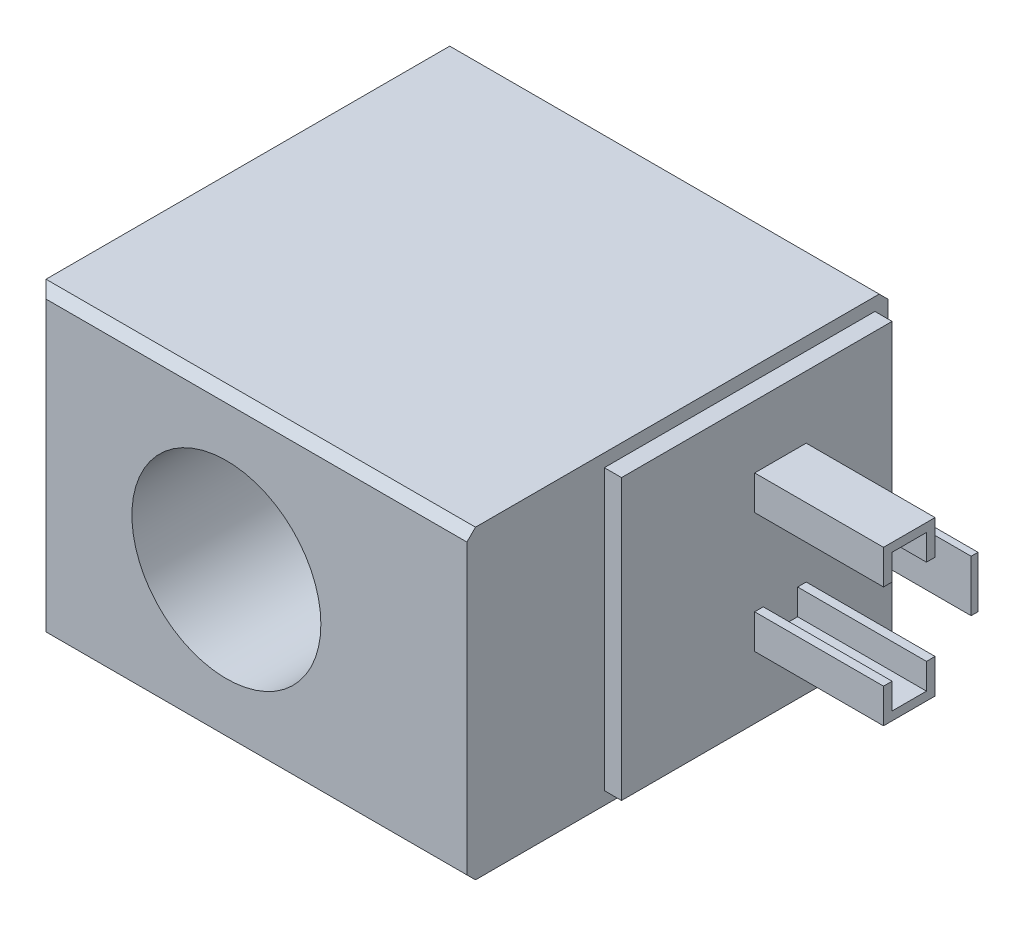
ISO-10303-21;
HEADER;
FILE_DESCRIPTION(('STEP AP214'),'2;1');
FILE_NAME('part.step','',(''),(''),'','','');
FILE_SCHEMA(('AUTOMOTIVE_DESIGN { 1 0 10303 214 1 1 1 1 }'));
ENDSEC;
DATA;
#1=APPLICATION_CONTEXT('core data for automotive mechanical design processes');
#2=APPLICATION_PROTOCOL_DEFINITION('international standard','automotive_design',2000,#1);
#3=PRODUCT_CONTEXT('',#1,'mechanical');
#4=PRODUCT('Part','Part','',(#3));
#5=PRODUCT_RELATED_PRODUCT_CATEGORY('part','',(#4));
#6=PRODUCT_DEFINITION_FORMATION('','',#4);
#7=PRODUCT_DEFINITION_CONTEXT('part definition',#1,'design');
#8=PRODUCT_DEFINITION('design','',#6,#7);
#9=PRODUCT_DEFINITION_SHAPE('','',#8);
#10=(LENGTH_UNIT() NAMED_UNIT(*) SI_UNIT(.MILLI.,.METRE.));
#11=(NAMED_UNIT(*) PLANE_ANGLE_UNIT() SI_UNIT($,.RADIAN.));
#12=(NAMED_UNIT(*) SI_UNIT($,.STERADIAN.) SOLID_ANGLE_UNIT());
#13=UNCERTAINTY_MEASURE_WITH_UNIT(LENGTH_MEASURE(1.E-05),#10,'distance_accuracy_value','');
#14=(GEOMETRIC_REPRESENTATION_CONTEXT(3) GLOBAL_UNCERTAINTY_ASSIGNED_CONTEXT((#13)) GLOBAL_UNIT_ASSIGNED_CONTEXT((#10,
#11,#12)) REPRESENTATION_CONTEXT('',''));
#15=CARTESIAN_POINT('',(0.,0.,0.));
#16=DIRECTION('',(0.,0.,1.));
#17=DIRECTION('',(1.,0.,0.));
#18=AXIS2_PLACEMENT_3D('',#15,#16,#17);
#19=CARTESIAN_POINT('',(27.,0.,0.));
#20=DIRECTION('',(-1.,0.,0.));
#21=DIRECTION('',(0.,0.,1.));
#22=AXIS2_PLACEMENT_3D('',#19,#20,#21);
#23=PLANE('',#22);
#24=DIRECTION('',(0.,-1.,0.));
#25=VECTOR('',#24,1.);
#26=CARTESIAN_POINT('',(27.,3.,7.3));
#27=LINE('',#26,#25);
#28=CARTESIAN_POINT('',(27.,3.,7.3));
#29=VERTEX_POINT('',#28);
#30=CARTESIAN_POINT('',(27.,-3.,7.3));
#31=VERTEX_POINT('',#30);
#32=EDGE_CURVE('E278',#29,#31,#27,.T.);
#33=ORIENTED_EDGE('',*,*,#32,.F.);
#34=DIRECTION('',(0.,0.,1.));
#35=VECTOR('',#34,1.);
#36=CARTESIAN_POINT('',(27.,3.,7.3));
#37=LINE('',#36,#35);
#38=CARTESIAN_POINT('',(27.,3.,6.5));
#39=VERTEX_POINT('',#38);
#40=EDGE_CURVE('E294',#39,#29,#37,.T.);
#41=ORIENTED_EDGE('',*,*,#40,.F.);
#42=DIRECTION('',(0.,1.,0.));
#43=VECTOR('',#42,1.);
#44=CARTESIAN_POINT('',(27.,3.,6.5));
#45=LINE('',#44,#43);
#46=CARTESIAN_POINT('',(27.,-3.,6.5));
#47=VERTEX_POINT('',#46);
#48=EDGE_CURVE('E307',#47,#39,#45,.T.);
#49=ORIENTED_EDGE('',*,*,#48,.F.);
#50=DIRECTION('',(0.,0.,-1.));
#51=VECTOR('',#50,1.);
#52=CARTESIAN_POINT('',(27.,-3.,7.3));
#53=LINE('',#52,#51);
#54=EDGE_CURVE('E283',#31,#47,#53,.T.);
#55=ORIENTED_EDGE('',*,*,#54,.F.);
#56=EDGE_LOOP('',(#33,#41,#49,#55));
#57=FACE_BOUND('',#56,.T.);
#58=DIRECTION('',(0.,0.,1.));
#59=VECTOR('',#58,1.);
#60=CARTESIAN_POINT('',(27.,16.28,33.));
#61=LINE('',#60,#59);
#62=CARTESIAN_POINT('',(27.,16.28,1.5));
#63=VERTEX_POINT('',#62);
#64=CARTESIAN_POINT('',(27.,16.28,33.));
#65=VERTEX_POINT('',#64);
#66=EDGE_CURVE('E419',#63,#65,#61,.T.);
#67=ORIENTED_EDGE('',*,*,#66,.T.);
#68=DIRECTION('',(0.,-1.,0.));
#69=VECTOR('',#68,1.);
#70=CARTESIAN_POINT('',(27.,16.28,33.));
#71=LINE('',#70,#69);
#72=CARTESIAN_POINT('',(27.,-16.28,33.));
#73=VERTEX_POINT('',#72);
#74=EDGE_CURVE('E423',#65,#73,#71,.T.);
#75=ORIENTED_EDGE('',*,*,#74,.T.);
#76=DIRECTION('',(0.,0.,-1.));
#77=VECTOR('',#76,1.);
#78=CARTESIAN_POINT('',(27.,-16.28,1.5));
#79=LINE('',#78,#77);
#80=CARTESIAN_POINT('',(27.,-16.28,1.5));
#81=VERTEX_POINT('',#80);
#82=EDGE_CURVE('E427',#73,#81,#79,.T.);
#83=ORIENTED_EDGE('',*,*,#82,.T.);
#84=DIRECTION('',(0.,1.,0.));
#85=VECTOR('',#84,1.);
#86=CARTESIAN_POINT('',(27.,16.28,1.5));
#87=LINE('',#86,#85);
#88=EDGE_CURVE('E430',#81,#63,#87,.T.);
#89=ORIENTED_EDGE('',*,*,#88,.T.);
#90=EDGE_LOOP('',(#67,#75,#83,#89));
#91=FACE_BOUND('',#90,.T.);
#92=DIRECTION('',(0.,-1.,0.));
#93=VECTOR('',#92,1.);
#94=CARTESIAN_POINT('',(27.,5.,17.5));
#95=LINE('',#94,#93);
#96=CARTESIAN_POINT('',(27.,9.,17.5));
#97=VERTEX_POINT('',#96);
#98=CARTESIAN_POINT('',(27.,5.,17.5));
#99=VERTEX_POINT('',#98);
#100=EDGE_CURVE('E329',#97,#99,#95,.T.);
#101=ORIENTED_EDGE('',*,*,#100,.F.);
#102=DIRECTION('',(0.,0.,1.));
#103=VECTOR('',#102,1.);
#104=CARTESIAN_POINT('',(27.,9.,17.5));
#105=LINE('',#104,#103);
#106=CARTESIAN_POINT('',(27.,9.,11.5));
#107=VERTEX_POINT('',#106);
#108=EDGE_CURVE('E335',#107,#97,#105,.T.);
#109=ORIENTED_EDGE('',*,*,#108,.F.);
#110=DIRECTION('',(0.,1.,0.));
#111=VECTOR('',#110,1.);
#112=CARTESIAN_POINT('',(27.,5.,11.5));
#113=LINE('',#112,#111);
#114=CARTESIAN_POINT('',(27.,5.,11.5));
#115=VERTEX_POINT('',#114);
#116=EDGE_CURVE('E380',#115,#107,#113,.T.);
#117=ORIENTED_EDGE('',*,*,#116,.F.);
#118=DIRECTION('',(0.,0.,-1.));
#119=VECTOR('',#118,1.);
#120=CARTESIAN_POINT('',(27.,5.,12.5));
#121=LINE('',#120,#119);
#122=CARTESIAN_POINT('',(27.,5.,12.5));
#123=VERTEX_POINT('',#122);
#124=EDGE_CURVE('E376',#123,#115,#121,.T.);
#125=ORIENTED_EDGE('',*,*,#124,.F.);
#126=DIRECTION('',(0.,-1.,0.));
#127=VECTOR('',#126,1.);
#128=CARTESIAN_POINT('',(27.,5.,12.5));
#129=LINE('',#128,#127);
#130=CARTESIAN_POINT('',(27.,8.,12.5));
#131=VERTEX_POINT('',#130);
#132=EDGE_CURVE('E372',#131,#123,#129,.T.);
#133=ORIENTED_EDGE('',*,*,#132,.F.);
#134=DIRECTION('',(0.,0.,-1.));
#135=VECTOR('',#134,1.);
#136=CARTESIAN_POINT('',(27.,8.,16.5));
#137=LINE('',#136,#135);
#138=CARTESIAN_POINT('',(27.,8.,16.5));
#139=VERTEX_POINT('',#138);
#140=EDGE_CURVE('E368',#139,#131,#137,.T.);
#141=ORIENTED_EDGE('',*,*,#140,.F.);
#142=DIRECTION('',(0.,1.,0.));
#143=VECTOR('',#142,1.);
#144=CARTESIAN_POINT('',(27.,5.,16.5));
#145=LINE('',#144,#143);
#146=CARTESIAN_POINT('',(27.,5.,16.5));
#147=VERTEX_POINT('',#146);
#148=EDGE_CURVE('E364',#147,#139,#145,.T.);
#149=ORIENTED_EDGE('',*,*,#148,.F.);
#150=DIRECTION('',(0.,0.,-1.));
#151=VECTOR('',#150,1.);
#152=CARTESIAN_POINT('',(27.,5.,17.5));
#153=LINE('',#152,#151);
#154=EDGE_CURVE('E360',#99,#147,#153,.T.);
#155=ORIENTED_EDGE('',*,*,#154,.F.);
#156=EDGE_LOOP('',(#101,#109,#117,#125,#133,#141,#149,#155));
#157=FACE_BOUND('',#156,.T.);
#158=DIRECTION('',(0.,-1.,0.));
#159=VECTOR('',#158,1.);
#160=CARTESIAN_POINT('',(27.,-5.,12.5));
#161=LINE('',#160,#159);
#162=CARTESIAN_POINT('',(27.,-5.,12.5));
#163=VERTEX_POINT('',#162);
#164=CARTESIAN_POINT('',(27.,-8.,12.5));
#165=VERTEX_POINT('',#164);
#166=EDGE_CURVE('E276',#163,#165,#161,.T.);
#167=ORIENTED_EDGE('',*,*,#166,.F.);
#168=DIRECTION('',(0.,0.,1.));
#169=VECTOR('',#168,1.);
#170=CARTESIAN_POINT('',(27.,-5.,12.5));
#171=LINE('',#170,#169);
#172=CARTESIAN_POINT('',(27.,-5.,11.5));
#173=VERTEX_POINT('',#172);
#174=EDGE_CURVE('E273',#173,#163,#171,.T.);
#175=ORIENTED_EDGE('',*,*,#174,.F.);
#176=DIRECTION('',(0.,1.,0.));
#177=VECTOR('',#176,1.);
#178=CARTESIAN_POINT('',(27.,-5.,11.5));
#179=LINE('',#178,#177);
#180=CARTESIAN_POINT('',(27.,-9.,11.5));
#181=VERTEX_POINT('',#180);
#182=EDGE_CURVE('E664',#181,#173,#179,.T.);
#183=ORIENTED_EDGE('',*,*,#182,.F.);
#184=DIRECTION('',(0.,0.,-1.));
#185=VECTOR('',#184,1.);
#186=CARTESIAN_POINT('',(27.,-9.,17.5));
#187=LINE('',#186,#185);
#188=CARTESIAN_POINT('',(27.,-9.,17.5));
#189=VERTEX_POINT('',#188);
#190=EDGE_CURVE('E711',#189,#181,#187,.T.);
#191=ORIENTED_EDGE('',*,*,#190,.F.);
#192=DIRECTION('',(0.,-1.,0.));
#193=VECTOR('',#192,1.);
#194=CARTESIAN_POINT('',(27.,-5.,17.5));
#195=LINE('',#194,#193);
#196=CARTESIAN_POINT('',(27.,-5.,17.5));
#197=VERTEX_POINT('',#196);
#198=EDGE_CURVE('E704',#197,#189,#195,.T.);
#199=ORIENTED_EDGE('',*,*,#198,.F.);
#200=DIRECTION('',(0.,0.,1.));
#201=VECTOR('',#200,1.);
#202=CARTESIAN_POINT('',(27.,-5.,17.5));
#203=LINE('',#202,#201);
#204=CARTESIAN_POINT('',(27.,-5.,16.5));
#205=VERTEX_POINT('',#204);
#206=EDGE_CURVE('E694',#205,#197,#203,.T.);
#207=ORIENTED_EDGE('',*,*,#206,.F.);
#208=DIRECTION('',(0.,1.,0.));
#209=VECTOR('',#208,1.);
#210=CARTESIAN_POINT('',(27.,-5.,16.5));
#211=LINE('',#210,#209);
#212=CARTESIAN_POINT('',(27.,-8.,16.5));
#213=VERTEX_POINT('',#212);
#214=EDGE_CURVE('E699',#213,#205,#211,.T.);
#215=ORIENTED_EDGE('',*,*,#214,.F.);
#216=DIRECTION('',(0.,0.,1.));
#217=VECTOR('',#216,1.);
#218=CARTESIAN_POINT('',(27.,-8.,16.5));
#219=LINE('',#218,#217);
#220=EDGE_CURVE('E654',#165,#213,#219,.T.);
#221=ORIENTED_EDGE('',*,*,#220,.F.);
#222=EDGE_LOOP('',(#167,#175,#183,#191,#199,#207,#215,#221));
#223=FACE_BOUND('',#222,.T.);
#224=ADVANCED_FACE('F41',(#57,#91,#157,#223),#23,.F.);
#225=CARTESIAN_POINT('',(25.,-17.78,49.));
#226=DIRECTION('',(-1.,0.,0.));
#227=DIRECTION('',(0.,0.,1.));
#228=AXIS2_PLACEMENT_3D('',#225,#226,#227);
#229=PLANE('',#228);
#230=DIRECTION('',(0.,0.,-1.));
#231=VECTOR('',#230,1.);
#232=CARTESIAN_POINT('',(25.,17.78,49.));
#233=LINE('',#232,#231);
#234=CARTESIAN_POINT('',(25.,17.78,48.));
#235=VERTEX_POINT('',#234);
#236=CARTESIAN_POINT('',(25.,17.78,1.));
#237=VERTEX_POINT('',#236);
#238=EDGE_CURVE('E483',#235,#237,#233,.T.);
#239=ORIENTED_EDGE('',*,*,#238,.F.);
#240=DIRECTION('',(0.,-0.707106781186548,0.707106781186548));
#241=VECTOR('',#240,1.);
#242=CARTESIAN_POINT('',(25.,16.78,49.));
#243=LINE('',#242,#241);
#244=CARTESIAN_POINT('',(25.,16.78,49.));
#245=VERTEX_POINT('',#244);
#246=EDGE_CURVE('E520',#235,#245,#243,.T.);
#247=ORIENTED_EDGE('',*,*,#246,.T.);
#248=DIRECTION('',(0.,1.,0.));
#249=VECTOR('',#248,1.);
#250=CARTESIAN_POINT('',(25.,-17.78,49.));
#251=LINE('',#250,#249);
#252=CARTESIAN_POINT('',(25.,-16.78,49.));
#253=VERTEX_POINT('',#252);
#254=EDGE_CURVE('E472',#253,#245,#251,.T.);
#255=ORIENTED_EDGE('',*,*,#254,.F.);
#256=DIRECTION('',(0.,-0.707106781186548,-0.707106781186548));
#257=VECTOR('',#256,1.);
#258=CARTESIAN_POINT('',(25.,-16.78,49.));
#259=LINE('',#258,#257);
#260=CARTESIAN_POINT('',(25.,-17.78,48.));
#261=VERTEX_POINT('',#260);
#262=EDGE_CURVE('E517',#253,#261,#259,.T.);
#263=ORIENTED_EDGE('',*,*,#262,.T.);
#264=DIRECTION('',(0.,0.,-1.));
#265=VECTOR('',#264,1.);
#266=CARTESIAN_POINT('',(25.,-17.78,49.));
#267=LINE('',#266,#265);
#268=CARTESIAN_POINT('',(25.,-17.78,1.));
#269=VERTEX_POINT('',#268);
#270=EDGE_CURVE('E487',#261,#269,#267,.T.);
#271=ORIENTED_EDGE('',*,*,#270,.T.);
#272=DIRECTION('',(0.,-0.707106781186548,0.707106781186548));
#273=VECTOR('',#272,1.);
#274=CARTESIAN_POINT('',(25.,-17.78,1.));
#275=LINE('',#274,#273);
#276=CARTESIAN_POINT('',(25.,-16.78,0.));
#277=VERTEX_POINT('',#276);
#278=EDGE_CURVE('E514',#269,#277,#275,.F.);
#279=ORIENTED_EDGE('',*,*,#278,.T.);
#280=DIRECTION('',(0.,1.,0.));
#281=VECTOR('',#280,1.);
#282=CARTESIAN_POINT('',(25.,-17.78,0.));
#283=LINE('',#282,#281);
#284=CARTESIAN_POINT('',(25.,16.78,0.));
#285=VERTEX_POINT('',#284);
#286=EDGE_CURVE('E468',#277,#285,#283,.T.);
#287=ORIENTED_EDGE('',*,*,#286,.T.);
#288=DIRECTION('',(0.,-0.707106781186548,-0.707106781186548));
#289=VECTOR('',#288,1.);
#290=CARTESIAN_POINT('',(25.,17.78,1.));
#291=LINE('',#290,#289);
#292=EDGE_CURVE('E511',#285,#237,#291,.F.);
#293=ORIENTED_EDGE('',*,*,#292,.T.);
#294=EDGE_LOOP('',(#239,#247,#255,#263,#271,#279,#287,#293));
#295=FACE_BOUND('',#294,.T.);
#296=DIRECTION('',(0.,0.,1.));
#297=VECTOR('',#296,1.);
#298=CARTESIAN_POINT('',(25.,16.28,33.));
#299=LINE('',#298,#297);
#300=CARTESIAN_POINT('',(25.,16.28,1.5));
#301=VERTEX_POINT('',#300);
#302=CARTESIAN_POINT('',(25.,16.28,33.));
#303=VERTEX_POINT('',#302);
#304=EDGE_CURVE('E418',#301,#303,#299,.T.);
#305=ORIENTED_EDGE('',*,*,#304,.F.);
#306=DIRECTION('',(0.,1.,0.));
#307=VECTOR('',#306,1.);
#308=CARTESIAN_POINT('',(25.,16.28,1.5));
#309=LINE('',#308,#307);
#310=CARTESIAN_POINT('',(25.,-16.28,1.5));
#311=VERTEX_POINT('',#310);
#312=EDGE_CURVE('E424',#311,#301,#309,.T.);
#313=ORIENTED_EDGE('',*,*,#312,.F.);
#314=DIRECTION('',(0.,0.,-1.));
#315=VECTOR('',#314,1.);
#316=CARTESIAN_POINT('',(25.,-16.28,1.5));
#317=LINE('',#316,#315);
#318=CARTESIAN_POINT('',(25.,-16.28,33.));
#319=VERTEX_POINT('',#318);
#320=EDGE_CURVE('E441',#319,#311,#317,.T.);
#321=ORIENTED_EDGE('',*,*,#320,.F.);
#322=DIRECTION('',(0.,-1.,0.));
#323=VECTOR('',#322,1.);
#324=CARTESIAN_POINT('',(25.,16.28,33.));
#325=LINE('',#324,#323);
#326=EDGE_CURVE('E437',#303,#319,#325,.T.);
#327=ORIENTED_EDGE('',*,*,#326,.F.);
#328=EDGE_LOOP('',(#305,#313,#321,#327));
#329=FACE_BOUND('',#328,.T.);
#330=ADVANCED_FACE('F566',(#295,#329),#229,.F.);
#331=CARTESIAN_POINT('',(0.,0.,49.));
#332=DIRECTION('',(0.,0.,1.));
#333=DIRECTION('',(1.,0.,0.));
#334=AXIS2_PLACEMENT_3D('',#331,#332,#333);
#335=PLANE('',#334);
#336=ORIENTED_EDGE('',*,*,#254,.T.);
#337=DIRECTION('',(-1.,0.,0.));
#338=VECTOR('',#337,1.);
#339=CARTESIAN_POINT('',(-25.,16.78,49.));
#340=LINE('',#339,#338);
#341=CARTESIAN_POINT('',(-24.,16.78,49.));
#342=VERTEX_POINT('',#341);
#343=EDGE_CURVE('E501',#245,#342,#340,.T.);
#344=ORIENTED_EDGE('',*,*,#343,.T.);
#345=DIRECTION('',(0.,-1.,0.));
#346=VECTOR('',#345,1.);
#347=CARTESIAN_POINT('',(-24.,-17.78,49.));
#348=LINE('',#347,#346);
#349=CARTESIAN_POINT('',(-24.,-16.78,49.));
#350=VERTEX_POINT('',#349);
#351=EDGE_CURVE('E498',#342,#350,#348,.T.);
#352=ORIENTED_EDGE('',*,*,#351,.T.);
#353=DIRECTION('',(1.,0.,0.));
#354=VECTOR('',#353,1.);
#355=CARTESIAN_POINT('',(25.,-16.78,49.));
#356=LINE('',#355,#354);
#357=EDGE_CURVE('E495',#350,#253,#356,.T.);
#358=ORIENTED_EDGE('',*,*,#357,.T.);
#359=EDGE_LOOP('',(#336,#344,#352,#358));
#360=FACE_BOUND('',#359,.T.);
#361=CARTESIAN_POINT('',(-3.,0.,49.));
#362=DIRECTION('',(0.,0.,1.));
#363=DIRECTION('',(1.,0.,0.));
#364=AXIS2_PLACEMENT_3D('',#361,#362,#363);
#365=CIRCLE('',#364,11.);
#366=CARTESIAN_POINT('',(8.,0.,49.));
#367=VERTEX_POINT('',#366);
#368=EDGE_CURVE('E464',#367,#367,#365,.T.);
#369=ORIENTED_EDGE('',*,*,#368,.F.);
#370=EDGE_LOOP('',(#369));
#371=FACE_BOUND('',#370,.T.);
#372=ADVANCED_FACE('F596',(#360,#371),#335,.T.);
#373=CARTESIAN_POINT('',(0.,0.,0.));
#374=DIRECTION('',(0.,0.,1.));
#375=DIRECTION('',(1.,0.,0.));
#376=AXIS2_PLACEMENT_3D('',#373,#374,#375);
#377=PLANE('',#376);
#378=ORIENTED_EDGE('',*,*,#286,.F.);
#379=DIRECTION('',(-1.,0.,0.));
#380=VECTOR('',#379,1.);
#381=CARTESIAN_POINT('',(0.,-16.78,0.));
#382=LINE('',#381,#380);
#383=CARTESIAN_POINT('',(-24.,-16.78,0.));
#384=VERTEX_POINT('',#383);
#385=EDGE_CURVE('E11',#277,#384,#382,.T.);
#386=ORIENTED_EDGE('',*,*,#385,.T.);
#387=DIRECTION('',(0.,1.,0.));
#388=VECTOR('',#387,1.);
#389=CARTESIAN_POINT('',(-24.,0.,0.));
#390=LINE('',#389,#388);
#391=CARTESIAN_POINT('',(-24.,16.78,0.));
#392=VERTEX_POINT('',#391);
#393=EDGE_CURVE('E52',#384,#392,#390,.T.);
#394=ORIENTED_EDGE('',*,*,#393,.T.);
#395=DIRECTION('',(1.,0.,0.));
#396=VECTOR('',#395,1.);
#397=CARTESIAN_POINT('',(0.,16.78,0.));
#398=LINE('',#397,#396);
#399=EDGE_CURVE('E536',#392,#285,#398,.T.);
#400=ORIENTED_EDGE('',*,*,#399,.T.);
#401=EDGE_LOOP('',(#378,#386,#394,#400));
#402=FACE_BOUND('',#401,.T.);
#403=CARTESIAN_POINT('',(-3.,0.,0.));
#404=DIRECTION('',(0.,0.,1.));
#405=DIRECTION('',(1.,0.,0.));
#406=AXIS2_PLACEMENT_3D('',#403,#404,#405);
#407=CIRCLE('',#406,11.);
#408=CARTESIAN_POINT('',(8.,0.,0.));
#409=VERTEX_POINT('',#408);
#410=EDGE_CURVE('E463',#409,#409,#407,.T.);
#411=ORIENTED_EDGE('',*,*,#410,.T.);
#412=EDGE_LOOP('',(#411));
#413=FACE_BOUND('',#412,.T.);
#414=ADVANCED_FACE('F562',(#402,#413),#377,.F.);
#415=CARTESIAN_POINT('',(-25.,-17.78,49.));
#416=DIRECTION('',(1.,0.,0.));
#417=DIRECTION('',(0.,0.,-1.));
#418=AXIS2_PLACEMENT_3D('',#415,#416,#417);
#419=PLANE('',#418);
#420=DIRECTION('',(0.,0.,-1.));
#421=VECTOR('',#420,1.);
#422=CARTESIAN_POINT('',(-25.,-17.78,49.));
#423=LINE('',#422,#421);
#424=CARTESIAN_POINT('',(-25.,-17.78,48.));
#425=VERTEX_POINT('',#424);
#426=CARTESIAN_POINT('',(-25.,-17.78,1.));
#427=VERTEX_POINT('',#426);
#428=EDGE_CURVE('E491',#425,#427,#423,.T.);
#429=ORIENTED_EDGE('',*,*,#428,.F.);
#430=DIRECTION('',(0.,1.,0.));
#431=VECTOR('',#430,1.);
#432=CARTESIAN_POINT('',(-25.,17.78,48.));
#433=LINE('',#432,#431);
#434=CARTESIAN_POINT('',(-25.,17.78,48.));
#435=VERTEX_POINT('',#434);
#436=EDGE_CURVE('E526',#425,#435,#433,.T.);
#437=ORIENTED_EDGE('',*,*,#436,.T.);
#438=DIRECTION('',(0.,0.,-1.));
#439=VECTOR('',#438,1.);
#440=CARTESIAN_POINT('',(-25.,17.78,49.));
#441=LINE('',#440,#439);
#442=CARTESIAN_POINT('',(-25.,17.78,1.));
#443=VERTEX_POINT('',#442);
#444=EDGE_CURVE('E476',#435,#443,#441,.T.);
#445=ORIENTED_EDGE('',*,*,#444,.T.);
#446=DIRECTION('',(0.,-1.,0.));
#447=VECTOR('',#446,1.);
#448=CARTESIAN_POINT('',(-25.,-17.78,1.));
#449=LINE('',#448,#447);
#450=EDGE_CURVE('E523',#443,#427,#449,.T.);
#451=ORIENTED_EDGE('',*,*,#450,.T.);
#452=EDGE_LOOP('',(#429,#437,#445,#451));
#453=FACE_BOUND('',#452,.T.);
#454=ADVANCED_FACE('F576',(#453),#419,.F.);
#455=CARTESIAN_POINT('',(25.,-17.78,49.));
#456=DIRECTION('',(0.,1.,0.));
#457=DIRECTION('',(-1.,0.,0.));
#458=AXIS2_PLACEMENT_3D('',#455,#456,#457);
#459=PLANE('',#458);
#460=ORIENTED_EDGE('',*,*,#270,.F.);
#461=DIRECTION('',(-1.,0.,0.));
#462=VECTOR('',#461,1.);
#463=CARTESIAN_POINT('',(-25.,-17.78,48.));
#464=LINE('',#463,#462);
#465=EDGE_CURVE('E533',#261,#425,#464,.T.);
#466=ORIENTED_EDGE('',*,*,#465,.T.);
#467=ORIENTED_EDGE('',*,*,#428,.T.);
#468=DIRECTION('',(1.,0.,0.));
#469=VECTOR('',#468,1.);
#470=CARTESIAN_POINT('',(25.,-17.78,1.));
#471=LINE('',#470,#469);
#472=EDGE_CURVE('E529',#427,#269,#471,.T.);
#473=ORIENTED_EDGE('',*,*,#472,.T.);
#474=EDGE_LOOP('',(#460,#466,#467,#473));
#475=FACE_BOUND('',#474,.T.);
#476=ADVANCED_FACE('F571',(#475),#459,.F.);
#477=CARTESIAN_POINT('',(25.,17.78,49.));
#478=DIRECTION('',(0.,-1.,0.));
#479=DIRECTION('',(1.,0.,0.));
#480=AXIS2_PLACEMENT_3D('',#477,#478,#479);
#481=PLANE('',#480);
#482=ORIENTED_EDGE('',*,*,#444,.F.);
#483=DIRECTION('',(1.,0.,0.));
#484=VECTOR('',#483,1.);
#485=CARTESIAN_POINT('',(25.,17.78,48.));
#486=LINE('',#485,#484);
#487=EDGE_CURVE('E508',#435,#235,#486,.T.);
#488=ORIENTED_EDGE('',*,*,#487,.T.);
#489=ORIENTED_EDGE('',*,*,#238,.T.);
#490=DIRECTION('',(-1.,0.,0.));
#491=VECTOR('',#490,1.);
#492=CARTESIAN_POINT('',(25.,17.78,1.));
#493=LINE('',#492,#491);
#494=EDGE_CURVE('E505',#237,#443,#493,.T.);
#495=ORIENTED_EDGE('',*,*,#494,.T.);
#496=EDGE_LOOP('',(#482,#488,#489,#495));
#497=FACE_BOUND('',#496,.T.);
#498=ADVANCED_FACE('F593',(#497),#481,.F.);
#499=CARTESIAN_POINT('',(-3.,0.,49.));
#500=DIRECTION('',(0.,0.,-1.));
#501=DIRECTION('',(-1.,0.,0.));
#502=AXIS2_PLACEMENT_3D('',#499,#500,#501);
#503=CYLINDRICAL_SURFACE('',#502,11.);
#504=ORIENTED_EDGE('',*,*,#368,.T.);
#505=EDGE_LOOP('',(#504));
#506=FACE_BOUND('',#505,.T.);
#507=ORIENTED_EDGE('',*,*,#410,.F.);
#508=EDGE_LOOP('',(#507));
#509=FACE_BOUND('',#508,.T.);
#510=ADVANCED_FACE('F602',(#506,#509),#503,.F.);
#511=CARTESIAN_POINT('',(27.,16.28,33.));
#512=DIRECTION('',(0.,-1.,0.));
#513=DIRECTION('',(0.,0.,-1.));
#514=AXIS2_PLACEMENT_3D('',#511,#512,#513);
#515=PLANE('',#514);
#516=ORIENTED_EDGE('',*,*,#304,.T.);
#517=DIRECTION('',(-1.,0.,0.));
#518=VECTOR('',#517,1.);
#519=CARTESIAN_POINT('',(27.,16.28,33.));
#520=LINE('',#519,#518);
#521=EDGE_CURVE('E459',#65,#303,#520,.T.);
#522=ORIENTED_EDGE('',*,*,#521,.F.);
#523=ORIENTED_EDGE('',*,*,#66,.F.);
#524=DIRECTION('',(-1.,0.,0.));
#525=VECTOR('',#524,1.);
#526=CARTESIAN_POINT('',(27.,16.28,1.5));
#527=LINE('',#526,#525);
#528=EDGE_CURVE('E433',#63,#301,#527,.T.);
#529=ORIENTED_EDGE('',*,*,#528,.T.);
#530=EDGE_LOOP('',(#516,#522,#523,#529));
#531=FACE_BOUND('',#530,.T.);
#532=ADVANCED_FACE('F605',(#531),#515,.F.);
#533=CARTESIAN_POINT('',(27.,16.28,33.));
#534=DIRECTION('',(0.,0.,-1.));
#535=DIRECTION('',(0.,1.,0.));
#536=AXIS2_PLACEMENT_3D('',#533,#534,#535);
#537=PLANE('',#536);
#538=ORIENTED_EDGE('',*,*,#326,.T.);
#539=DIRECTION('',(-1.,0.,0.));
#540=VECTOR('',#539,1.);
#541=CARTESIAN_POINT('',(27.,-16.28,33.));
#542=LINE('',#541,#540);
#543=EDGE_CURVE('E455',#73,#319,#542,.T.);
#544=ORIENTED_EDGE('',*,*,#543,.F.);
#545=ORIENTED_EDGE('',*,*,#74,.F.);
#546=ORIENTED_EDGE('',*,*,#521,.T.);
#547=EDGE_LOOP('',(#538,#544,#545,#546));
#548=FACE_BOUND('',#547,.T.);
#549=ADVANCED_FACE('F634',(#548),#537,.F.);
#550=CARTESIAN_POINT('',(27.,-16.28,1.5));
#551=DIRECTION('',(0.,1.,0.));
#552=DIRECTION('',(0.,0.,1.));
#553=AXIS2_PLACEMENT_3D('',#550,#551,#552);
#554=PLANE('',#553);
#555=ORIENTED_EDGE('',*,*,#320,.T.);
#556=DIRECTION('',(-1.,0.,0.));
#557=VECTOR('',#556,1.);
#558=CARTESIAN_POINT('',(27.,-16.28,1.5));
#559=LINE('',#558,#557);
#560=EDGE_CURVE('E451',#81,#311,#559,.T.);
#561=ORIENTED_EDGE('',*,*,#560,.F.);
#562=ORIENTED_EDGE('',*,*,#82,.F.);
#563=ORIENTED_EDGE('',*,*,#543,.T.);
#564=EDGE_LOOP('',(#555,#561,#562,#563));
#565=FACE_BOUND('',#564,.T.);
#566=ADVANCED_FACE('F630',(#565),#554,.F.);
#567=CARTESIAN_POINT('',(27.,16.28,1.5));
#568=DIRECTION('',(0.,0.,1.));
#569=DIRECTION('',(0.,-1.,0.));
#570=AXIS2_PLACEMENT_3D('',#567,#568,#569);
#571=PLANE('',#570);
#572=ORIENTED_EDGE('',*,*,#312,.T.);
#573=ORIENTED_EDGE('',*,*,#528,.F.);
#574=ORIENTED_EDGE('',*,*,#88,.F.);
#575=ORIENTED_EDGE('',*,*,#560,.T.);
#576=EDGE_LOOP('',(#572,#573,#574,#575));
#577=FACE_BOUND('',#576,.T.);
#578=ADVANCED_FACE('F627',(#577),#571,.F.);
#579=CARTESIAN_POINT('',(42.,5.,17.5));
#580=DIRECTION('',(0.,0.,-1.));
#581=DIRECTION('',(-1.,0.,0.));
#582=AXIS2_PLACEMENT_3D('',#579,#580,#581);
#583=PLANE('',#582);
#584=ORIENTED_EDGE('',*,*,#100,.T.);
#585=DIRECTION('',(-1.,0.,0.));
#586=VECTOR('',#585,1.);
#587=CARTESIAN_POINT('',(42.,5.,17.5));
#588=LINE('',#587,#586);
#589=CARTESIAN_POINT('',(42.,5.,17.5));
#590=VERTEX_POINT('',#589);
#591=EDGE_CURVE('E414',#590,#99,#588,.T.);
#592=ORIENTED_EDGE('',*,*,#591,.F.);
#593=DIRECTION('',(0.,-1.,0.));
#594=VECTOR('',#593,1.);
#595=CARTESIAN_POINT('',(42.,5.,17.5));
#596=LINE('',#595,#594);
#597=CARTESIAN_POINT('',(42.,9.,17.5));
#598=VERTEX_POINT('',#597);
#599=EDGE_CURVE('E330',#598,#590,#596,.T.);
#600=ORIENTED_EDGE('',*,*,#599,.F.);
#601=DIRECTION('',(-1.,0.,0.));
#602=VECTOR('',#601,1.);
#603=CARTESIAN_POINT('',(42.,9.,17.5));
#604=LINE('',#603,#602);
#605=EDGE_CURVE('E356',#598,#97,#604,.T.);
#606=ORIENTED_EDGE('',*,*,#605,.T.);
#607=EDGE_LOOP('',(#584,#592,#600,#606));
#608=FACE_BOUND('',#607,.T.);
#609=ADVANCED_FACE('F625',(#608),#583,.F.);
#610=CARTESIAN_POINT('',(42.,5.,17.5));
#611=DIRECTION('',(0.,1.,0.));
#612=DIRECTION('',(0.,0.,1.));
#613=AXIS2_PLACEMENT_3D('',#610,#611,#612);
#614=PLANE('',#613);
#615=ORIENTED_EDGE('',*,*,#154,.T.);
#616=DIRECTION('',(-1.,0.,0.));
#617=VECTOR('',#616,1.);
#618=CARTESIAN_POINT('',(42.,5.,16.5));
#619=LINE('',#618,#617);
#620=CARTESIAN_POINT('',(42.,5.,16.5));
#621=VERTEX_POINT('',#620);
#622=EDGE_CURVE('E410',#621,#147,#619,.T.);
#623=ORIENTED_EDGE('',*,*,#622,.F.);
#624=DIRECTION('',(0.,0.,-1.));
#625=VECTOR('',#624,1.);
#626=CARTESIAN_POINT('',(42.,5.,17.5));
#627=LINE('',#626,#625);
#628=EDGE_CURVE('E334',#590,#621,#627,.T.);
#629=ORIENTED_EDGE('',*,*,#628,.F.);
#630=ORIENTED_EDGE('',*,*,#591,.T.);
#631=EDGE_LOOP('',(#615,#623,#629,#630));
#632=FACE_BOUND('',#631,.T.);
#633=ADVANCED_FACE('F800',(#632),#614,.F.);
#634=CARTESIAN_POINT('',(42.,5.,16.5));
#635=DIRECTION('',(0.,0.,1.));
#636=DIRECTION('',(1.,0.,0.));
#637=AXIS2_PLACEMENT_3D('',#634,#635,#636);
#638=PLANE('',#637);
#639=ORIENTED_EDGE('',*,*,#148,.T.);
#640=DIRECTION('',(-1.,0.,0.));
#641=VECTOR('',#640,1.);
#642=CARTESIAN_POINT('',(42.,8.,16.5));
#643=LINE('',#642,#641);
#644=CARTESIAN_POINT('',(42.,8.,16.5));
#645=VERTEX_POINT('',#644);
#646=EDGE_CURVE('E406',#645,#139,#643,.T.);
#647=ORIENTED_EDGE('',*,*,#646,.F.);
#648=DIRECTION('',(0.,1.,0.));
#649=VECTOR('',#648,1.);
#650=CARTESIAN_POINT('',(42.,5.,16.5));
#651=LINE('',#650,#649);
#652=EDGE_CURVE('E338',#621,#645,#651,.T.);
#653=ORIENTED_EDGE('',*,*,#652,.F.);
#654=ORIENTED_EDGE('',*,*,#622,.T.);
#655=EDGE_LOOP('',(#639,#647,#653,#654));
#656=FACE_BOUND('',#655,.T.);
#657=ADVANCED_FACE('F797',(#656),#638,.F.);
#658=CARTESIAN_POINT('',(42.,8.,16.5));
#659=DIRECTION('',(0.,1.,0.));
#660=DIRECTION('',(0.,0.,1.));
#661=AXIS2_PLACEMENT_3D('',#658,#659,#660);
#662=PLANE('',#661);
#663=ORIENTED_EDGE('',*,*,#140,.T.);
#664=DIRECTION('',(-1.,0.,0.));
#665=VECTOR('',#664,1.);
#666=CARTESIAN_POINT('',(42.,8.,12.5));
#667=LINE('',#666,#665);
#668=CARTESIAN_POINT('',(42.,8.,12.5));
#669=VERTEX_POINT('',#668);
#670=EDGE_CURVE('E402',#669,#131,#667,.T.);
#671=ORIENTED_EDGE('',*,*,#670,.F.);
#672=DIRECTION('',(0.,0.,-1.));
#673=VECTOR('',#672,1.);
#674=CARTESIAN_POINT('',(42.,8.,16.5));
#675=LINE('',#674,#673);
#676=EDGE_CURVE('E341',#645,#669,#675,.T.);
#677=ORIENTED_EDGE('',*,*,#676,.F.);
#678=ORIENTED_EDGE('',*,*,#646,.T.);
#679=EDGE_LOOP('',(#663,#671,#677,#678));
#680=FACE_BOUND('',#679,.T.);
#681=ADVANCED_FACE('F793',(#680),#662,.F.);
#682=CARTESIAN_POINT('',(42.,5.,12.5));
#683=DIRECTION('',(0.,0.,-1.));
#684=DIRECTION('',(-1.,0.,0.));
#685=AXIS2_PLACEMENT_3D('',#682,#683,#684);
#686=PLANE('',#685);
#687=ORIENTED_EDGE('',*,*,#132,.T.);
#688=DIRECTION('',(-1.,0.,0.));
#689=VECTOR('',#688,1.);
#690=CARTESIAN_POINT('',(42.,5.,12.5));
#691=LINE('',#690,#689);
#692=CARTESIAN_POINT('',(42.,5.,12.5));
#693=VERTEX_POINT('',#692);
#694=EDGE_CURVE('E398',#693,#123,#691,.T.);
#695=ORIENTED_EDGE('',*,*,#694,.F.);
#696=DIRECTION('',(0.,-1.,0.));
#697=VECTOR('',#696,1.);
#698=CARTESIAN_POINT('',(42.,5.,12.5));
#699=LINE('',#698,#697);
#700=EDGE_CURVE('E344',#669,#693,#699,.T.);
#701=ORIENTED_EDGE('',*,*,#700,.F.);
#702=ORIENTED_EDGE('',*,*,#670,.T.);
#703=EDGE_LOOP('',(#687,#695,#701,#702));
#704=FACE_BOUND('',#703,.T.);
#705=ADVANCED_FACE('F789',(#704),#686,.F.);
#706=CARTESIAN_POINT('',(42.,5.,12.5));
#707=DIRECTION('',(0.,1.,0.));
#708=DIRECTION('',(0.,0.,1.));
#709=AXIS2_PLACEMENT_3D('',#706,#707,#708);
#710=PLANE('',#709);
#711=ORIENTED_EDGE('',*,*,#124,.T.);
#712=DIRECTION('',(-1.,0.,0.));
#713=VECTOR('',#712,1.);
#714=CARTESIAN_POINT('',(42.,5.,11.5));
#715=LINE('',#714,#713);
#716=CARTESIAN_POINT('',(42.,5.,11.5));
#717=VERTEX_POINT('',#716);
#718=EDGE_CURVE('E394',#717,#115,#715,.T.);
#719=ORIENTED_EDGE('',*,*,#718,.F.);
#720=DIRECTION('',(0.,0.,-1.));
#721=VECTOR('',#720,1.);
#722=CARTESIAN_POINT('',(42.,5.,12.5));
#723=LINE('',#722,#721);
#724=EDGE_CURVE('E347',#693,#717,#723,.T.);
#725=ORIENTED_EDGE('',*,*,#724,.F.);
#726=ORIENTED_EDGE('',*,*,#694,.T.);
#727=EDGE_LOOP('',(#711,#719,#725,#726));
#728=FACE_BOUND('',#727,.T.);
#729=ADVANCED_FACE('F785',(#728),#710,.F.);
#730=CARTESIAN_POINT('',(42.,5.,11.5));
#731=DIRECTION('',(0.,0.,1.));
#732=DIRECTION('',(1.,0.,0.));
#733=AXIS2_PLACEMENT_3D('',#730,#731,#732);
#734=PLANE('',#733);
#735=ORIENTED_EDGE('',*,*,#116,.T.);
#736=DIRECTION('',(-1.,0.,0.));
#737=VECTOR('',#736,1.);
#738=CARTESIAN_POINT('',(42.,9.,11.5));
#739=LINE('',#738,#737);
#740=CARTESIAN_POINT('',(42.,9.,11.5));
#741=VERTEX_POINT('',#740);
#742=EDGE_CURVE('E390',#741,#107,#739,.T.);
#743=ORIENTED_EDGE('',*,*,#742,.F.);
#744=DIRECTION('',(0.,1.,0.));
#745=VECTOR('',#744,1.);
#746=CARTESIAN_POINT('',(42.,5.,11.5));
#747=LINE('',#746,#745);
#748=EDGE_CURVE('E350',#717,#741,#747,.T.);
#749=ORIENTED_EDGE('',*,*,#748,.F.);
#750=ORIENTED_EDGE('',*,*,#718,.T.);
#751=EDGE_LOOP('',(#735,#743,#749,#750));
#752=FACE_BOUND('',#751,.T.);
#753=ADVANCED_FACE('F781',(#752),#734,.F.);
#754=CARTESIAN_POINT('',(42.,9.,17.5));
#755=DIRECTION('',(0.,-1.,0.));
#756=DIRECTION('',(0.,0.,-1.));
#757=AXIS2_PLACEMENT_3D('',#754,#755,#756);
#758=PLANE('',#757);
#759=ORIENTED_EDGE('',*,*,#108,.T.);
#760=ORIENTED_EDGE('',*,*,#605,.F.);
#761=DIRECTION('',(0.,0.,1.));
#762=VECTOR('',#761,1.);
#763=CARTESIAN_POINT('',(42.,9.,17.5));
#764=LINE('',#763,#762);
#765=EDGE_CURVE('E353',#741,#598,#764,.T.);
#766=ORIENTED_EDGE('',*,*,#765,.F.);
#767=ORIENTED_EDGE('',*,*,#742,.T.);
#768=EDGE_LOOP('',(#759,#760,#766,#767));
#769=FACE_BOUND('',#768,.T.);
#770=ADVANCED_FACE('F777',(#769),#758,.F.);
#771=CARTESIAN_POINT('',(42.,0.,0.));
#772=DIRECTION('',(-1.,0.,0.));
#773=DIRECTION('',(0.,0.,1.));
#774=AXIS2_PLACEMENT_3D('',#771,#772,#773);
#775=PLANE('',#774);
#776=ORIENTED_EDGE('',*,*,#599,.T.);
#777=ORIENTED_EDGE('',*,*,#628,.T.);
#778=ORIENTED_EDGE('',*,*,#652,.T.);
#779=ORIENTED_EDGE('',*,*,#676,.T.);
#780=ORIENTED_EDGE('',*,*,#700,.T.);
#781=ORIENTED_EDGE('',*,*,#724,.T.);
#782=ORIENTED_EDGE('',*,*,#748,.T.);
#783=ORIENTED_EDGE('',*,*,#765,.T.);
#784=EDGE_LOOP('',(#776,#777,#778,#779,#780,#781,#782,#783));
#785=FACE_BOUND('',#784,.T.);
#786=ADVANCED_FACE('F773',(#785),#775,.F.);
#787=CARTESIAN_POINT('',(42.,3.,7.3));
#788=DIRECTION('',(0.,0.,-1.));
#789=DIRECTION('',(-1.,0.,0.));
#790=AXIS2_PLACEMENT_3D('',#787,#788,#789);
#791=PLANE('',#790);
#792=ORIENTED_EDGE('',*,*,#32,.T.);
#793=DIRECTION('',(-1.,0.,0.));
#794=VECTOR('',#793,1.);
#795=CARTESIAN_POINT('',(42.,-3.,7.3));
#796=LINE('',#795,#794);
#797=CARTESIAN_POINT('',(42.,-3.,7.3));
#798=VERTEX_POINT('',#797);
#799=EDGE_CURVE('E325',#798,#31,#796,.T.);
#800=ORIENTED_EDGE('',*,*,#799,.F.);
#801=DIRECTION('',(0.,-1.,0.));
#802=VECTOR('',#801,1.);
#803=CARTESIAN_POINT('',(42.,3.,7.3));
#804=LINE('',#803,#802);
#805=CARTESIAN_POINT('',(42.,3.,7.3));
#806=VERTEX_POINT('',#805);
#807=EDGE_CURVE('E289',#806,#798,#804,.T.);
#808=ORIENTED_EDGE('',*,*,#807,.F.);
#809=DIRECTION('',(-1.,0.,0.));
#810=VECTOR('',#809,1.);
#811=CARTESIAN_POINT('',(42.,3.,7.3));
#812=LINE('',#811,#810);
#813=EDGE_CURVE('E302',#806,#29,#812,.T.);
#814=ORIENTED_EDGE('',*,*,#813,.T.);
#815=EDGE_LOOP('',(#792,#800,#808,#814));
#816=FACE_BOUND('',#815,.T.);
#817=ADVANCED_FACE('F769',(#816),#791,.F.);
#818=CARTESIAN_POINT('',(42.,-3.,7.3));
#819=DIRECTION('',(0.,1.,0.));
#820=DIRECTION('',(0.,0.,1.));
#821=AXIS2_PLACEMENT_3D('',#818,#819,#820);
#822=PLANE('',#821);
#823=ORIENTED_EDGE('',*,*,#54,.T.);
#824=DIRECTION('',(-1.,0.,0.));
#825=VECTOR('',#824,1.);
#826=CARTESIAN_POINT('',(42.,-3.,6.5));
#827=LINE('',#826,#825);
#828=CARTESIAN_POINT('',(42.,-3.,6.5));
#829=VERTEX_POINT('',#828);
#830=EDGE_CURVE('E321',#829,#47,#827,.T.);
#831=ORIENTED_EDGE('',*,*,#830,.F.);
#832=DIRECTION('',(0.,0.,-1.));
#833=VECTOR('',#832,1.);
#834=CARTESIAN_POINT('',(42.,-3.,7.3));
#835=LINE('',#834,#833);
#836=EDGE_CURVE('E293',#798,#829,#835,.T.);
#837=ORIENTED_EDGE('',*,*,#836,.F.);
#838=ORIENTED_EDGE('',*,*,#799,.T.);
#839=EDGE_LOOP('',(#823,#831,#837,#838));
#840=FACE_BOUND('',#839,.T.);
#841=ADVANCED_FACE('F765',(#840),#822,.F.);
#842=CARTESIAN_POINT('',(42.,3.,6.5));
#843=DIRECTION('',(0.,0.,1.));
#844=DIRECTION('',(1.,0.,0.));
#845=AXIS2_PLACEMENT_3D('',#842,#843,#844);
#846=PLANE('',#845);
#847=ORIENTED_EDGE('',*,*,#48,.T.);
#848=DIRECTION('',(-1.,0.,0.));
#849=VECTOR('',#848,1.);
#850=CARTESIAN_POINT('',(42.,3.,6.5));
#851=LINE('',#850,#849);
#852=CARTESIAN_POINT('',(42.,3.,6.5));
#853=VERTEX_POINT('',#852);
#854=EDGE_CURVE('E317',#853,#39,#851,.T.);
#855=ORIENTED_EDGE('',*,*,#854,.F.);
#856=DIRECTION('',(0.,1.,0.));
#857=VECTOR('',#856,1.);
#858=CARTESIAN_POINT('',(42.,3.,6.5));
#859=LINE('',#858,#857);
#860=EDGE_CURVE('E297',#829,#853,#859,.T.);
#861=ORIENTED_EDGE('',*,*,#860,.F.);
#862=ORIENTED_EDGE('',*,*,#830,.T.);
#863=EDGE_LOOP('',(#847,#855,#861,#862));
#864=FACE_BOUND('',#863,.T.);
#865=ADVANCED_FACE('F761',(#864),#846,.F.);
#866=CARTESIAN_POINT('',(42.,3.,7.3));
#867=DIRECTION('',(0.,-1.,0.));
#868=DIRECTION('',(0.,0.,-1.));
#869=AXIS2_PLACEMENT_3D('',#866,#867,#868);
#870=PLANE('',#869);
#871=ORIENTED_EDGE('',*,*,#40,.T.);
#872=ORIENTED_EDGE('',*,*,#813,.F.);
#873=DIRECTION('',(0.,0.,1.));
#874=VECTOR('',#873,1.);
#875=CARTESIAN_POINT('',(42.,3.,7.3));
#876=LINE('',#875,#874);
#877=EDGE_CURVE('E300',#853,#806,#876,.T.);
#878=ORIENTED_EDGE('',*,*,#877,.F.);
#879=ORIENTED_EDGE('',*,*,#854,.T.);
#880=EDGE_LOOP('',(#871,#872,#878,#879));
#881=FACE_BOUND('',#880,.T.);
#882=ADVANCED_FACE('F757',(#881),#870,.F.);
#883=CARTESIAN_POINT('',(42.,0.,0.));
#884=DIRECTION('',(1.,0.,0.));
#885=DIRECTION('',(0.,0.,-1.));
#886=AXIS2_PLACEMENT_3D('',#883,#884,#885);
#887=PLANE('',#886);
#888=ORIENTED_EDGE('',*,*,#807,.T.);
#889=ORIENTED_EDGE('',*,*,#836,.T.);
#890=ORIENTED_EDGE('',*,*,#860,.T.);
#891=ORIENTED_EDGE('',*,*,#877,.T.);
#892=EDGE_LOOP('',(#888,#889,#890,#891));
#893=FACE_BOUND('',#892,.T.);
#894=ADVANCED_FACE('F754',(#893),#887,.T.);
#895=CARTESIAN_POINT('',(42.,-5.,12.5));
#896=DIRECTION('',(0.,0.,-1.));
#897=DIRECTION('',(-1.,0.,0.));
#898=AXIS2_PLACEMENT_3D('',#895,#896,#897);
#899=PLANE('',#898);
#900=ORIENTED_EDGE('',*,*,#166,.T.);
#901=DIRECTION('',(-1.,0.,0.));
#902=VECTOR('',#901,1.);
#903=CARTESIAN_POINT('',(42.,-8.,12.5));
#904=LINE('',#903,#902);
#905=CARTESIAN_POINT('',(42.,-8.,12.5));
#906=VERTEX_POINT('',#905);
#907=EDGE_CURVE('E255',#906,#165,#904,.T.);
#908=ORIENTED_EDGE('',*,*,#907,.F.);
#909=DIRECTION('',(0.,-1.,0.));
#910=VECTOR('',#909,1.);
#911=CARTESIAN_POINT('',(42.,-5.,12.5));
#912=LINE('',#911,#910);
#913=CARTESIAN_POINT('',(42.,-5.,12.5));
#914=VERTEX_POINT('',#913);
#915=EDGE_CURVE('E263',#914,#906,#912,.T.);
#916=ORIENTED_EDGE('',*,*,#915,.F.);
#917=DIRECTION('',(-1.,0.,0.));
#918=VECTOR('',#917,1.);
#919=CARTESIAN_POINT('',(42.,-5.,12.5));
#920=LINE('',#919,#918);
#921=EDGE_CURVE('E660',#914,#163,#920,.T.);
#922=ORIENTED_EDGE('',*,*,#921,.T.);
#923=EDGE_LOOP('',(#900,#908,#916,#922));
#924=FACE_BOUND('',#923,.T.);
#925=ADVANCED_FACE('F275',(#924),#899,.F.);
#926=CARTESIAN_POINT('',(42.,-8.,16.5));
#927=DIRECTION('',(0.,-1.,0.));
#928=DIRECTION('',(0.,0.,-1.));
#929=AXIS2_PLACEMENT_3D('',#926,#927,#928);
#930=PLANE('',#929);
#931=ORIENTED_EDGE('',*,*,#220,.T.);
#932=DIRECTION('',(-1.,0.,0.));
#933=VECTOR('',#932,1.);
#934=CARTESIAN_POINT('',(42.,-8.,16.5));
#935=LINE('',#934,#933);
#936=CARTESIAN_POINT('',(42.,-8.,16.5));
#937=VERTEX_POINT('',#936);
#938=EDGE_CURVE('E258',#937,#213,#935,.T.);
#939=ORIENTED_EDGE('',*,*,#938,.F.);
#940=DIRECTION('',(0.,0.,1.));
#941=VECTOR('',#940,1.);
#942=CARTESIAN_POINT('',(42.,-8.,16.5));
#943=LINE('',#942,#941);
#944=EDGE_CURVE('E250',#906,#937,#943,.T.);
#945=ORIENTED_EDGE('',*,*,#944,.F.);
#946=ORIENTED_EDGE('',*,*,#907,.T.);
#947=EDGE_LOOP('',(#931,#939,#945,#946));
#948=FACE_BOUND('',#947,.T.);
#949=ADVANCED_FACE('F253',(#948),#930,.F.);
#950=CARTESIAN_POINT('',(42.,-5.,16.5));
#951=DIRECTION('',(0.,0.,1.));
#952=DIRECTION('',(1.,0.,0.));
#953=AXIS2_PLACEMENT_3D('',#950,#951,#952);
#954=PLANE('',#953);
#955=ORIENTED_EDGE('',*,*,#214,.T.);
#956=DIRECTION('',(-1.,0.,0.));
#957=VECTOR('',#956,1.);
#958=CARTESIAN_POINT('',(42.,-5.,16.5));
#959=LINE('',#958,#957);
#960=CARTESIAN_POINT('',(42.,-5.,16.5));
#961=VERTEX_POINT('',#960);
#962=EDGE_CURVE('E285',#961,#205,#959,.T.);
#963=ORIENTED_EDGE('',*,*,#962,.F.);
#964=DIRECTION('',(0.,1.,0.));
#965=VECTOR('',#964,1.);
#966=CARTESIAN_POINT('',(42.,-5.,16.5));
#967=LINE('',#966,#965);
#968=EDGE_CURVE('E262',#937,#961,#967,.T.);
#969=ORIENTED_EDGE('',*,*,#968,.F.);
#970=ORIENTED_EDGE('',*,*,#938,.T.);
#971=EDGE_LOOP('',(#955,#963,#969,#970));
#972=FACE_BOUND('',#971,.T.);
#973=ADVANCED_FACE('F698',(#972),#954,.F.);
#974=CARTESIAN_POINT('',(42.,-5.,17.5));
#975=DIRECTION('',(0.,-1.,0.));
#976=DIRECTION('',(0.,0.,-1.));
#977=AXIS2_PLACEMENT_3D('',#974,#975,#976);
#978=PLANE('',#977);
#979=ORIENTED_EDGE('',*,*,#206,.T.);
#980=DIRECTION('',(-1.,0.,0.));
#981=VECTOR('',#980,1.);
#982=CARTESIAN_POINT('',(42.,-5.,17.5));
#983=LINE('',#982,#981);
#984=CARTESIAN_POINT('',(42.,-5.,17.5));
#985=VERTEX_POINT('',#984);
#986=EDGE_CURVE('E683',#985,#197,#983,.T.);
#987=ORIENTED_EDGE('',*,*,#986,.F.);
#988=DIRECTION('',(0.,0.,1.));
#989=VECTOR('',#988,1.);
#990=CARTESIAN_POINT('',(42.,-5.,17.5));
#991=LINE('',#990,#989);
#992=EDGE_CURVE('E695',#961,#985,#991,.T.);
#993=ORIENTED_EDGE('',*,*,#992,.F.);
#994=ORIENTED_EDGE('',*,*,#962,.T.);
#995=EDGE_LOOP('',(#979,#987,#993,#994));
#996=FACE_BOUND('',#995,.T.);
#997=ADVANCED_FACE('F692',(#996),#978,.F.);
#998=CARTESIAN_POINT('',(42.,-5.,17.5));
#999=DIRECTION('',(0.,0.,-1.));
#1000=DIRECTION('',(0.,1.,0.));
#1001=AXIS2_PLACEMENT_3D('',#998,#999,#1000);
#1002=PLANE('',#1001);
#1003=ORIENTED_EDGE('',*,*,#198,.T.);
#1004=DIRECTION('',(-1.,0.,0.));
#1005=VECTOR('',#1004,1.);
#1006=CARTESIAN_POINT('',(42.,-9.,17.5));
#1007=LINE('',#1006,#1005);
#1008=CARTESIAN_POINT('',(42.,-9.,17.5));
#1009=VERTEX_POINT('',#1008);
#1010=EDGE_CURVE('E679',#1009,#189,#1007,.T.);
#1011=ORIENTED_EDGE('',*,*,#1010,.F.);
#1012=DIRECTION('',(0.,-1.,0.));
#1013=VECTOR('',#1012,1.);
#1014=CARTESIAN_POINT('',(42.,-5.,17.5));
#1015=LINE('',#1014,#1013);
#1016=EDGE_CURVE('E727',#985,#1009,#1015,.T.);
#1017=ORIENTED_EDGE('',*,*,#1016,.F.);
#1018=ORIENTED_EDGE('',*,*,#986,.T.);
#1019=EDGE_LOOP('',(#1003,#1011,#1017,#1018));
#1020=FACE_BOUND('',#1019,.T.);
#1021=ADVANCED_FACE('F726',(#1020),#1002,.F.);
#1022=CARTESIAN_POINT('',(42.,-9.,17.5));
#1023=DIRECTION('',(0.,1.,0.));
#1024=DIRECTION('',(0.,0.,1.));
#1025=AXIS2_PLACEMENT_3D('',#1022,#1023,#1024);
#1026=PLANE('',#1025);
#1027=ORIENTED_EDGE('',*,*,#190,.T.);
#1028=DIRECTION('',(-1.,0.,0.));
#1029=VECTOR('',#1028,1.);
#1030=CARTESIAN_POINT('',(42.,-9.,11.5));
#1031=LINE('',#1030,#1029);
#1032=CARTESIAN_POINT('',(42.,-9.,11.5));
#1033=VERTEX_POINT('',#1032);
#1034=EDGE_CURVE('E670',#1033,#181,#1031,.T.);
#1035=ORIENTED_EDGE('',*,*,#1034,.F.);
#1036=DIRECTION('',(0.,0.,-1.));
#1037=VECTOR('',#1036,1.);
#1038=CARTESIAN_POINT('',(42.,-9.,17.5));
#1039=LINE('',#1038,#1037);
#1040=EDGE_CURVE('E723',#1009,#1033,#1039,.T.);
#1041=ORIENTED_EDGE('',*,*,#1040,.F.);
#1042=ORIENTED_EDGE('',*,*,#1010,.T.);
#1043=EDGE_LOOP('',(#1027,#1035,#1041,#1042));
#1044=FACE_BOUND('',#1043,.T.);
#1045=ADVANCED_FACE('F720',(#1044),#1026,.F.);
#1046=CARTESIAN_POINT('',(42.,-5.,11.5));
#1047=DIRECTION('',(0.,0.,1.));
#1048=DIRECTION('',(1.,0.,0.));
#1049=AXIS2_PLACEMENT_3D('',#1046,#1047,#1048);
#1050=PLANE('',#1049);
#1051=ORIENTED_EDGE('',*,*,#182,.T.);
#1052=DIRECTION('',(-1.,0.,0.));
#1053=VECTOR('',#1052,1.);
#1054=CARTESIAN_POINT('',(42.,-5.,11.5));
#1055=LINE('',#1054,#1053);
#1056=CARTESIAN_POINT('',(42.,-5.,11.5));
#1057=VERTEX_POINT('',#1056);
#1058=EDGE_CURVE('E662',#1057,#173,#1055,.T.);
#1059=ORIENTED_EDGE('',*,*,#1058,.F.);
#1060=DIRECTION('',(0.,1.,0.));
#1061=VECTOR('',#1060,1.);
#1062=CARTESIAN_POINT('',(42.,-5.,11.5));
#1063=LINE('',#1062,#1061);
#1064=EDGE_CURVE('E672',#1033,#1057,#1063,.T.);
#1065=ORIENTED_EDGE('',*,*,#1064,.F.);
#1066=ORIENTED_EDGE('',*,*,#1034,.T.);
#1067=EDGE_LOOP('',(#1051,#1059,#1065,#1066));
#1068=FACE_BOUND('',#1067,.T.);
#1069=ADVANCED_FACE('F716',(#1068),#1050,.F.);
#1070=CARTESIAN_POINT('',(42.,-5.,12.5));
#1071=DIRECTION('',(0.,-1.,0.));
#1072=DIRECTION('',(0.,0.,-1.));
#1073=AXIS2_PLACEMENT_3D('',#1070,#1071,#1072);
#1074=PLANE('',#1073);
#1075=ORIENTED_EDGE('',*,*,#174,.T.);
#1076=ORIENTED_EDGE('',*,*,#921,.F.);
#1077=DIRECTION('',(0.,0.,1.));
#1078=VECTOR('',#1077,1.);
#1079=CARTESIAN_POINT('',(42.,-5.,12.5));
#1080=LINE('',#1079,#1078);
#1081=EDGE_CURVE('E268',#1057,#914,#1080,.T.);
#1082=ORIENTED_EDGE('',*,*,#1081,.F.);
#1083=ORIENTED_EDGE('',*,*,#1058,.T.);
#1084=EDGE_LOOP('',(#1075,#1076,#1082,#1083));
#1085=FACE_BOUND('',#1084,.T.);
#1086=ADVANCED_FACE('F659',(#1085),#1074,.F.);
#1087=CARTESIAN_POINT('',(42.,0.,0.));
#1088=DIRECTION('',(1.,0.,0.));
#1089=DIRECTION('',(0.,0.,-1.));
#1090=AXIS2_PLACEMENT_3D('',#1087,#1088,#1089);
#1091=PLANE('',#1090);
#1092=ORIENTED_EDGE('',*,*,#915,.T.);
#1093=ORIENTED_EDGE('',*,*,#944,.T.);
#1094=ORIENTED_EDGE('',*,*,#968,.T.);
#1095=ORIENTED_EDGE('',*,*,#992,.T.);
#1096=ORIENTED_EDGE('',*,*,#1016,.T.);
#1097=ORIENTED_EDGE('',*,*,#1040,.T.);
#1098=ORIENTED_EDGE('',*,*,#1064,.T.);
#1099=ORIENTED_EDGE('',*,*,#1081,.T.);
#1100=EDGE_LOOP('',(#1092,#1093,#1094,#1095,#1096,#1097,#1098,#1099));
#1101=FACE_BOUND('',#1100,.T.);
#1102=ADVANCED_FACE('F266',(#1101),#1091,.T.);
#1103=CARTESIAN_POINT('',(0.,-16.78,49.));
#1104=DIRECTION('',(0.,-0.707106781186547,0.707106781186547));
#1105=DIRECTION('',(-1.,0.,0.));
#1106=AXIS2_PLACEMENT_3D('',#1103,#1104,#1105);
#1107=PLANE('',#1106);
#1108=ORIENTED_EDGE('',*,*,#262,.F.);
#1109=ORIENTED_EDGE('',*,*,#357,.F.);
#1110=DIRECTION('',(-0.577350269189626,-0.577350269189626,-0.577350269189626));
#1111=VECTOR('',#1110,1.);
#1112=CARTESIAN_POINT('',(-16.,-8.78,57.));
#1113=LINE('',#1112,#1111);
#1114=EDGE_CURVE('E544',#425,#350,#1113,.F.);
#1115=ORIENTED_EDGE('',*,*,#1114,.F.);
#1116=ORIENTED_EDGE('',*,*,#465,.F.);
#1117=EDGE_LOOP('',(#1108,#1109,#1115,#1116));
#1118=FACE_BOUND('',#1117,.T.);
#1119=ADVANCED_FACE('F582',(#1118),#1107,.T.);
#1120=CARTESIAN_POINT('',(-24.,0.,49.));
#1121=DIRECTION('',(-0.707106781186547,0.,0.707106781186547));
#1122=DIRECTION('',(0.,1.,0.));
#1123=AXIS2_PLACEMENT_3D('',#1120,#1121,#1122);
#1124=PLANE('',#1123);
#1125=ORIENTED_EDGE('',*,*,#1114,.T.);
#1126=ORIENTED_EDGE('',*,*,#351,.F.);
#1127=DIRECTION('',(-0.577350269189626,0.577350269189626,-0.577350269189626));
#1128=VECTOR('',#1127,1.);
#1129=CARTESIAN_POINT('',(-18.4066666666667,11.1866666666667,54.5933333333333));
#1130=LINE('',#1129,#1128);
#1131=EDGE_CURVE('E541',#435,#342,#1130,.F.);
#1132=ORIENTED_EDGE('',*,*,#1131,.F.);
#1133=ORIENTED_EDGE('',*,*,#436,.F.);
#1134=EDGE_LOOP('',(#1125,#1126,#1132,#1133));
#1135=FACE_BOUND('',#1134,.T.);
#1136=ADVANCED_FACE('F586',(#1135),#1124,.T.);
#1137=CARTESIAN_POINT('',(0.,16.78,49.));
#1138=DIRECTION('',(0.,0.707106781186547,0.707106781186547));
#1139=DIRECTION('',(1.,0.,0.));
#1140=AXIS2_PLACEMENT_3D('',#1137,#1138,#1139);
#1141=PLANE('',#1140);
#1142=ORIENTED_EDGE('',*,*,#246,.F.);
#1143=ORIENTED_EDGE('',*,*,#487,.F.);
#1144=ORIENTED_EDGE('',*,*,#1131,.T.);
#1145=ORIENTED_EDGE('',*,*,#343,.F.);
#1146=EDGE_LOOP('',(#1142,#1143,#1144,#1145));
#1147=FACE_BOUND('',#1146,.T.);
#1148=ADVANCED_FACE('F591',(#1147),#1141,.T.);
#1149=CARTESIAN_POINT('',(25.,17.78,1.));
#1150=DIRECTION('',(0.,-0.707106781186547,0.707106781186547));
#1151=DIRECTION('',(-1.,0.,0.));
#1152=AXIS2_PLACEMENT_3D('',#1149,#1150,#1151);
#1153=PLANE('',#1152);
#1154=ORIENTED_EDGE('',*,*,#292,.F.);
#1155=ORIENTED_EDGE('',*,*,#399,.F.);
#1156=DIRECTION('',(-0.577350269189626,0.577350269189626,0.577350269189626));
#1157=VECTOR('',#1156,1.);
#1158=CARTESIAN_POINT('',(-8.33333333333333,1.11333333333333,-15.6666666666667));
#1159=LINE('',#1158,#1157);
#1160=EDGE_CURVE('E46',#443,#392,#1159,.F.);
#1161=ORIENTED_EDGE('',*,*,#1160,.F.);
#1162=ORIENTED_EDGE('',*,*,#494,.F.);
#1163=EDGE_LOOP('',(#1154,#1155,#1161,#1162));
#1164=FACE_BOUND('',#1163,.T.);
#1165=ADVANCED_FACE('F44',(#1164),#1153,.F.);
#1166=CARTESIAN_POINT('',(-25.,-17.78,1.));
#1167=DIRECTION('',(0.707106781186547,0.,0.707106781186547));
#1168=DIRECTION('',(0.,-1.,0.));
#1169=AXIS2_PLACEMENT_3D('',#1166,#1167,#1168);
#1170=PLANE('',#1169);
#1171=ORIENTED_EDGE('',*,*,#1160,.T.);
#1172=ORIENTED_EDGE('',*,*,#393,.F.);
#1173=DIRECTION('',(-0.577350269189626,-0.577350269189626,0.577350269189626));
#1174=VECTOR('',#1173,1.);
#1175=CARTESIAN_POINT('',(-25.,-17.78,1.));
#1176=LINE('',#1175,#1174);
#1177=EDGE_CURVE('E547',#427,#384,#1176,.F.);
#1178=ORIENTED_EDGE('',*,*,#1177,.F.);
#1179=ORIENTED_EDGE('',*,*,#450,.F.);
#1180=EDGE_LOOP('',(#1171,#1172,#1178,#1179));
#1181=FACE_BOUND('',#1180,.T.);
#1182=ADVANCED_FACE('F558',(#1181),#1170,.F.);
#1183=CARTESIAN_POINT('',(25.,-17.78,1.));
#1184=DIRECTION('',(0.,0.707106781186547,0.707106781186547));
#1185=DIRECTION('',(1.,0.,0.));
#1186=AXIS2_PLACEMENT_3D('',#1183,#1184,#1185);
#1187=PLANE('',#1186);
#1188=ORIENTED_EDGE('',*,*,#1177,.T.);
#1189=ORIENTED_EDGE('',*,*,#385,.F.);
#1190=ORIENTED_EDGE('',*,*,#278,.F.);
#1191=ORIENTED_EDGE('',*,*,#472,.F.);
#1192=EDGE_LOOP('',(#1188,#1189,#1190,#1191));
#1193=FACE_BOUND('',#1192,.T.);
#1194=ADVANCED_FACE('F569',(#1193),#1187,.F.);
#1195=CLOSED_SHELL('',(#224,#330,#372,#414,#454,#476,#498,#510,#532,#549,#566,#578,#609,#633,
#657,#681,#705,#729,#753,#770,#786,#817,#841,#865,#882,#894,#925,#949,#973,#997,#1021,#1045,
#1069,#1086,#1102,#1119,#1136,#1148,#1165,#1182,#1194));
#1196=MANIFOLD_SOLID_BREP('B2',#1195);
#1197=ADVANCED_BREP_SHAPE_REPRESENTATION('',(#18,#1196),#14);
#1198=SHAPE_DEFINITION_REPRESENTATION(#9,#1197);
ENDSEC;
END-ISO-10303-21;
